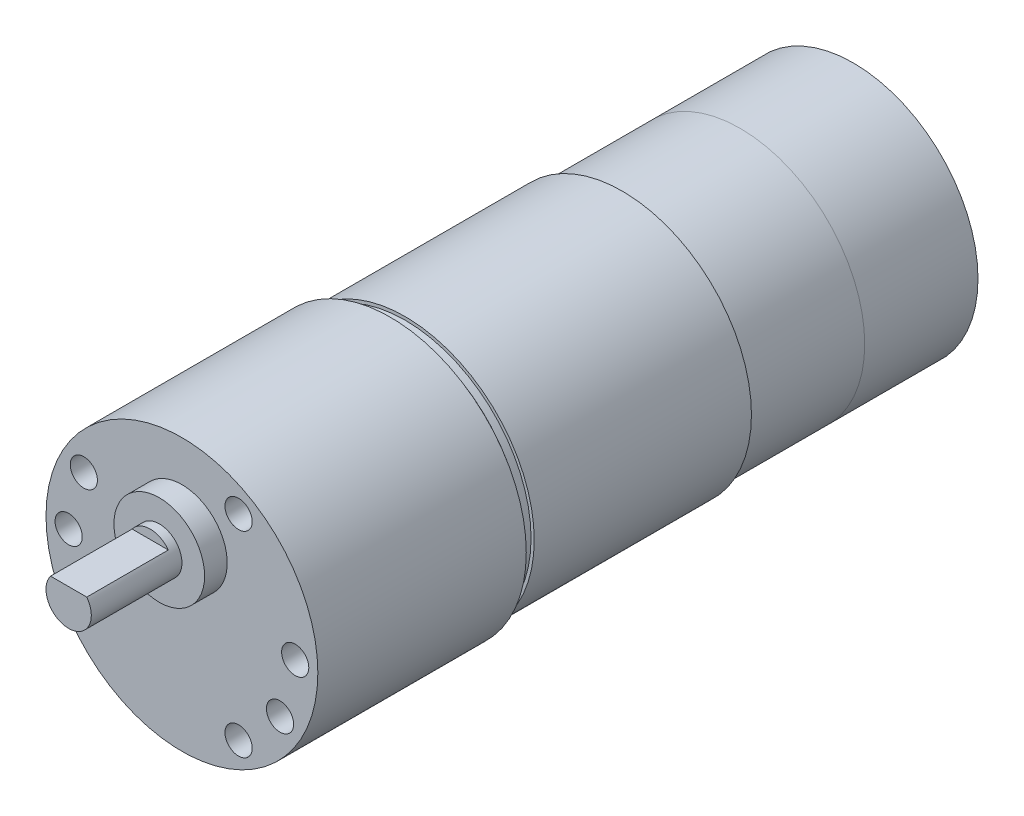
ISO-10303-21;
HEADER;
FILE_DESCRIPTION(('STEP AP214'),'2;1');
FILE_NAME('part.step','',(''),(''),'','','');
FILE_SCHEMA(('AUTOMOTIVE_DESIGN { 1 0 10303 214 1 1 1 1 }'));
ENDSEC;
DATA;
#1=APPLICATION_CONTEXT('core data for automotive mechanical design processes');
#2=APPLICATION_PROTOCOL_DEFINITION('international standard','automotive_design',2000,#1);
#3=PRODUCT_CONTEXT('',#1,'mechanical');
#4=PRODUCT('Part','Part','',(#3));
#5=PRODUCT_RELATED_PRODUCT_CATEGORY('part','',(#4));
#6=PRODUCT_DEFINITION_FORMATION('','',#4);
#7=PRODUCT_DEFINITION_CONTEXT('part definition',#1,'design');
#8=PRODUCT_DEFINITION('design','',#6,#7);
#9=PRODUCT_DEFINITION_SHAPE('','',#8);
#10=(LENGTH_UNIT() NAMED_UNIT(*) SI_UNIT(.MILLI.,.METRE.));
#11=(NAMED_UNIT(*) PLANE_ANGLE_UNIT() SI_UNIT($,.RADIAN.));
#12=(NAMED_UNIT(*) SI_UNIT($,.STERADIAN.) SOLID_ANGLE_UNIT());
#13=UNCERTAINTY_MEASURE_WITH_UNIT(LENGTH_MEASURE(1.E-05),#10,'distance_accuracy_value','');
#14=(GEOMETRIC_REPRESENTATION_CONTEXT(3) GLOBAL_UNCERTAINTY_ASSIGNED_CONTEXT((#13)) GLOBAL_UNIT_ASSIGNED_CONTEXT((#10,
#11,#12)) REPRESENTATION_CONTEXT('',''));
#15=CARTESIAN_POINT('',(0.,0.,0.));
#16=DIRECTION('',(0.,0.,1.));
#17=DIRECTION('',(1.,0.,0.));
#18=AXIS2_PLACEMENT_3D('',#15,#16,#17);
#19=CARTESIAN_POINT('',(0.,0.,-74.1));
#20=DIRECTION('',(0.,0.,1.));
#21=DIRECTION('',(1.,0.,0.));
#22=AXIS2_PLACEMENT_3D('',#19,#20,#21);
#23=CYLINDRICAL_SURFACE('',#22,13.75);
#24=CARTESIAN_POINT('',(0.,0.,-74.1));
#25=DIRECTION('',(0.,0.,-1.));
#26=DIRECTION('',(-1.,0.,0.));
#27=AXIS2_PLACEMENT_3D('',#24,#25,#26);
#28=CIRCLE('',#27,13.75);
#29=CARTESIAN_POINT('',(-13.75,0.,-74.1));
#30=VERTEX_POINT('',#29);
#31=EDGE_CURVE('E11',#30,#30,#28,.T.);
#32=ORIENTED_EDGE('',*,*,#31,.F.);
#33=EDGE_LOOP('',(#32));
#34=FACE_BOUND('',#33,.T.);
#35=CARTESIAN_POINT('',(0.,0.,-61.6));
#36=DIRECTION('',(0.,0.,-1.));
#37=DIRECTION('',(-1.,0.,0.));
#38=AXIS2_PLACEMENT_3D('',#35,#36,#37);
#39=CIRCLE('',#38,13.75);
#40=CARTESIAN_POINT('',(-13.75,0.,-61.6));
#41=VERTEX_POINT('',#40);
#42=EDGE_CURVE('E47',#41,#41,#39,.T.);
#43=ORIENTED_EDGE('',*,*,#42,.T.);
#44=EDGE_LOOP('',(#43));
#45=FACE_BOUND('',#44,.T.);
#46=ADVANCED_FACE('F44',(#34,#45),#23,.T.);
#47=CARTESIAN_POINT('',(0.,0.,-74.1));
#48=DIRECTION('',(0.,0.,-1.));
#49=DIRECTION('',(-1.,0.,0.));
#50=AXIS2_PLACEMENT_3D('',#47,#48,#49);
#51=PLANE('',#50);
#52=ORIENTED_EDGE('',*,*,#31,.T.);
#53=EDGE_LOOP('',(#52));
#54=FACE_BOUND('',#53,.T.);
#55=ADVANCED_FACE('F59',(#54),#51,.T.);
#56=CARTESIAN_POINT('',(0.,0.,-61.6));
#57=DIRECTION('',(0.,0.,-1.));
#58=DIRECTION('',(-1.,0.,0.));
#59=AXIS2_PLACEMENT_3D('',#56,#57,#58);
#60=PLANE('',#59);
#61=ORIENTED_EDGE('',*,*,#42,.F.);
#62=EDGE_LOOP('',(#61));
#63=FACE_BOUND('',#62,.T.);
#64=ADVANCED_FACE('F57',(#63),#60,.F.);
#65=CLOSED_SHELL('',(#46,#55,#64));
#66=MANIFOLD_SOLID_BREP('B2',#65);
#67=CARTESIAN_POINT('',(0.,5.5,2.5));
#68=DIRECTION('',(0.,0.,1.));
#69=DIRECTION('',(1.,0.,0.));
#70=AXIS2_PLACEMENT_3D('',#67,#68,#69);
#71=PLANE('',#70);
#72=CARTESIAN_POINT('',(0.,5.5,2.5));
#73=DIRECTION('',(0.,0.,1.));
#74=DIRECTION('',(1.,0.,0.));
#75=AXIS2_PLACEMENT_3D('',#72,#73,#74);
#76=CIRCLE('',#75,5.);
#77=CARTESIAN_POINT('',(5.,5.5,2.5));
#78=VERTEX_POINT('',#77);
#79=EDGE_CURVE('E137',#78,#78,#76,.T.);
#80=ORIENTED_EDGE('',*,*,#79,.T.);
#81=EDGE_LOOP('',(#80));
#82=FACE_BOUND('',#81,.T.);
#83=CARTESIAN_POINT('',(0.,5.5,2.5));
#84=DIRECTION('',(0.,0.,1.));
#85=DIRECTION('',(1.,0.,0.));
#86=AXIS2_PLACEMENT_3D('',#83,#84,#85);
#87=CIRCLE('',#86,2.5);
#88=CARTESIAN_POINT('',(2.5,5.5,2.5));
#89=VERTEX_POINT('',#88);
#90=EDGE_CURVE('E138',#89,#89,#87,.T.);
#91=ORIENTED_EDGE('',*,*,#90,.F.);
#92=EDGE_LOOP('',(#91));
#93=FACE_BOUND('',#92,.T.);
#94=ADVANCED_FACE('F99',(#82,#93),#71,.T.);
#95=CARTESIAN_POINT('',(0.,0.,0.));
#96=DIRECTION('',(0.,0.,-1.));
#97=DIRECTION('',(-1.,0.,0.));
#98=AXIS2_PLACEMENT_3D('',#95,#96,#97);
#99=PLANE('',#98);
#100=CARTESIAN_POINT('',(0.,0.,0.));
#101=DIRECTION('',(0.,0.,1.));
#102=DIRECTION('',(1.,0.,0.));
#103=AXIS2_PLACEMENT_3D('',#100,#101,#102);
#104=CIRCLE('',#103,15.);
#105=CARTESIAN_POINT('',(15.,0.,0.));
#106=VERTEX_POINT('',#105);
#107=EDGE_CURVE('E209',#106,#106,#104,.T.);
#108=ORIENTED_EDGE('',*,*,#107,.T.);
#109=EDGE_LOOP('',(#108));
#110=FACE_BOUND('',#109,.T.);
#111=CARTESIAN_POINT('',(-12.5,0.,0.));
#112=DIRECTION('',(0.,0.,1.));
#113=DIRECTION('',(1.,0.,0.));
#114=AXIS2_PLACEMENT_3D('',#111,#112,#113);
#115=CIRCLE('',#114,1.5);
#116=CARTESIAN_POINT('',(-11.,0.,0.));
#117=VERTEX_POINT('',#116);
#118=EDGE_CURVE('E174',#117,#117,#115,.T.);
#119=ORIENTED_EDGE('',*,*,#118,.F.);
#120=EDGE_LOOP('',(#119));
#121=FACE_BOUND('',#120,.T.);
#122=CARTESIAN_POINT('',(-10.8253175473055,6.24999999999993,0.));
#123=DIRECTION('',(0.,0.,1.));
#124=DIRECTION('',(1.,0.,0.));
#125=AXIS2_PLACEMENT_3D('',#122,#123,#124);
#126=CIRCLE('',#125,1.5);
#127=CARTESIAN_POINT('',(-9.32531754730552,6.24999999999993,0.));
#128=VERTEX_POINT('',#127);
#129=EDGE_CURVE('E168',#128,#128,#126,.T.);
#130=ORIENTED_EDGE('',*,*,#129,.F.);
#131=EDGE_LOOP('',(#130));
#132=FACE_BOUND('',#131,.T.);
#133=CARTESIAN_POINT('',(6.24999999999997,10.8253175473055,0.));
#134=DIRECTION('',(0.,0.,1.));
#135=DIRECTION('',(1.,0.,0.));
#136=AXIS2_PLACEMENT_3D('',#133,#134,#135);
#137=CIRCLE('',#136,1.5);
#138=CARTESIAN_POINT('',(7.74999999999997,10.8253175473055,0.));
#139=VERTEX_POINT('',#138);
#140=EDGE_CURVE('E162',#139,#139,#137,.T.);
#141=ORIENTED_EDGE('',*,*,#140,.F.);
#142=EDGE_LOOP('',(#141));
#143=FACE_BOUND('',#142,.T.);
#144=CARTESIAN_POINT('',(12.5,0.,0.));
#145=DIRECTION('',(0.,0.,1.));
#146=DIRECTION('',(1.,0.,0.));
#147=AXIS2_PLACEMENT_3D('',#144,#145,#146);
#148=CIRCLE('',#147,1.5);
#149=CARTESIAN_POINT('',(14.,0.,0.));
#150=VERTEX_POINT('',#149);
#151=EDGE_CURVE('E156',#150,#150,#148,.T.);
#152=ORIENTED_EDGE('',*,*,#151,.F.);
#153=EDGE_LOOP('',(#152));
#154=FACE_BOUND('',#153,.T.);
#155=CARTESIAN_POINT('',(10.8253175473055,-6.25000000000001,0.));
#156=DIRECTION('',(0.,0.,1.));
#157=DIRECTION('',(1.,0.,0.));
#158=AXIS2_PLACEMENT_3D('',#155,#156,#157);
#159=CIRCLE('',#158,1.5);
#160=CARTESIAN_POINT('',(12.3253175473055,-6.25000000000001,0.));
#161=VERTEX_POINT('',#160);
#162=EDGE_CURVE('E150',#161,#161,#159,.T.);
#163=ORIENTED_EDGE('',*,*,#162,.F.);
#164=EDGE_LOOP('',(#163));
#165=FACE_BOUND('',#164,.T.);
#166=CARTESIAN_POINT('',(6.24999999999998,-10.8253175473055,0.));
#167=DIRECTION('',(0.,0.,1.));
#168=DIRECTION('',(1.,0.,0.));
#169=AXIS2_PLACEMENT_3D('',#166,#167,#168);
#170=CIRCLE('',#169,1.5);
#171=CARTESIAN_POINT('',(7.74999999999998,-10.8253175473055,0.));
#172=VERTEX_POINT('',#171);
#173=EDGE_CURVE('E141',#172,#172,#170,.T.);
#174=ORIENTED_EDGE('',*,*,#173,.F.);
#175=EDGE_LOOP('',(#174));
#176=FACE_BOUND('',#175,.T.);
#177=CARTESIAN_POINT('',(0.,5.5,0.));
#178=DIRECTION('',(0.,0.,-1.));
#179=DIRECTION('',(-1.,0.,0.));
#180=AXIS2_PLACEMENT_3D('',#177,#178,#179);
#181=CIRCLE('',#180,5.);
#182=CARTESIAN_POINT('',(-5.,5.5,0.));
#183=VERTEX_POINT('',#182);
#184=EDGE_CURVE('E128',#183,#183,#181,.F.);
#185=ORIENTED_EDGE('',*,*,#184,.F.);
#186=EDGE_LOOP('',(#185));
#187=FACE_BOUND('',#186,.T.);
#188=ADVANCED_FACE('F101',(#110,#121,#132,#143,#154,#165,#176,#187),#99,.F.);
#189=CARTESIAN_POINT('',(0.,0.,0.));
#190=DIRECTION('',(0.,0.,1.));
#191=DIRECTION('',(1.,0.,0.));
#192=AXIS2_PLACEMENT_3D('',#189,#190,#191);
#193=CYLINDRICAL_SURFACE('',#192,15.);
#194=ORIENTED_EDGE('',*,*,#107,.F.);
#195=EDGE_LOOP('',(#194));
#196=FACE_BOUND('',#195,.T.);
#197=CARTESIAN_POINT('',(0.,0.,-23.));
#198=DIRECTION('',(0.,0.,1.));
#199=DIRECTION('',(1.,0.,0.));
#200=AXIS2_PLACEMENT_3D('',#197,#198,#199);
#201=CIRCLE('',#200,15.);
#202=CARTESIAN_POINT('',(15.,0.,-23.));
#203=VERTEX_POINT('',#202);
#204=EDGE_CURVE('E206',#203,#203,#201,.T.);
#205=ORIENTED_EDGE('',*,*,#204,.T.);
#206=EDGE_LOOP('',(#205));
#207=FACE_BOUND('',#206,.T.);
#208=ADVANCED_FACE('F218',(#196,#207),#193,.T.);
#209=CARTESIAN_POINT('',(0.,15.,-23.));
#210=DIRECTION('',(0.,0.,1.));
#211=DIRECTION('',(1.,0.,0.));
#212=AXIS2_PLACEMENT_3D('',#209,#210,#211);
#213=PLANE('',#212);
#214=ORIENTED_EDGE('',*,*,#204,.F.);
#215=EDGE_LOOP('',(#214));
#216=FACE_BOUND('',#215,.T.);
#217=CARTESIAN_POINT('',(0.,0.,-23.));
#218=DIRECTION('',(0.,0.,1.));
#219=DIRECTION('',(1.,0.,0.));
#220=AXIS2_PLACEMENT_3D('',#217,#218,#219);
#221=CIRCLE('',#220,13.1608692238094);
#222=CARTESIAN_POINT('',(13.1608692238094,0.,-23.));
#223=VERTEX_POINT('',#222);
#224=EDGE_CURVE('E203',#223,#223,#221,.T.);
#225=ORIENTED_EDGE('',*,*,#224,.T.);
#226=EDGE_LOOP('',(#225));
#227=FACE_BOUND('',#226,.T.);
#228=ADVANCED_FACE('F224',(#216,#227),#213,.F.);
#229=CARTESIAN_POINT('',(0.,0.,0.));
#230=DIRECTION('',(0.,0.,1.));
#231=DIRECTION('',(1.,0.,0.));
#232=AXIS2_PLACEMENT_3D('',#229,#230,#231);
#233=CYLINDRICAL_SURFACE('',#232,13.1608692238094);
#234=ORIENTED_EDGE('',*,*,#224,.F.);
#235=EDGE_LOOP('',(#234));
#236=FACE_BOUND('',#235,.T.);
#237=CARTESIAN_POINT('',(0.,0.,-23.8));
#238=DIRECTION('',(0.,0.,1.));
#239=DIRECTION('',(1.,0.,0.));
#240=AXIS2_PLACEMENT_3D('',#237,#238,#239);
#241=CIRCLE('',#240,13.1608692238094);
#242=CARTESIAN_POINT('',(13.1608692238094,0.,-23.8));
#243=VERTEX_POINT('',#242);
#244=EDGE_CURVE('E200',#243,#243,#241,.T.);
#245=ORIENTED_EDGE('',*,*,#244,.T.);
#246=EDGE_LOOP('',(#245));
#247=FACE_BOUND('',#246,.T.);
#248=ADVANCED_FACE('F322',(#236,#247),#233,.T.);
#249=CARTESIAN_POINT('',(0.,13.1608692238094,-23.8));
#250=DIRECTION('',(0.,0.,-1.));
#251=DIRECTION('',(-1.,0.,0.));
#252=AXIS2_PLACEMENT_3D('',#249,#250,#251);
#253=PLANE('',#252);
#254=ORIENTED_EDGE('',*,*,#244,.F.);
#255=EDGE_LOOP('',(#254));
#256=FACE_BOUND('',#255,.T.);
#257=CARTESIAN_POINT('',(0.,0.,-23.8));
#258=DIRECTION('',(0.,0.,1.));
#259=DIRECTION('',(1.,0.,0.));
#260=AXIS2_PLACEMENT_3D('',#257,#258,#259);
#261=CIRCLE('',#260,13.9001885477519);
#262=CARTESIAN_POINT('',(13.9001885477519,0.,-23.8));
#263=VERTEX_POINT('',#262);
#264=EDGE_CURVE('E197',#263,#263,#261,.T.);
#265=ORIENTED_EDGE('',*,*,#264,.T.);
#266=EDGE_LOOP('',(#265));
#267=FACE_BOUND('',#266,.T.);
#268=ADVANCED_FACE('F318',(#256,#267),#253,.F.);
#269=CARTESIAN_POINT('',(0.,0.,0.));
#270=DIRECTION('',(0.,0.,1.));
#271=DIRECTION('',(1.,0.,0.));
#272=AXIS2_PLACEMENT_3D('',#269,#270,#271);
#273=CYLINDRICAL_SURFACE('',#272,13.9001885477519);
#274=ORIENTED_EDGE('',*,*,#264,.F.);
#275=EDGE_LOOP('',(#274));
#276=FACE_BOUND('',#275,.T.);
#277=CARTESIAN_POINT('',(0.,0.,-24.6291574327881));
#278=DIRECTION('',(0.,0.,1.));
#279=DIRECTION('',(1.,0.,0.));
#280=AXIS2_PLACEMENT_3D('',#277,#278,#279);
#281=CIRCLE('',#280,13.9001885477519);
#282=CARTESIAN_POINT('',(13.9001885477519,0.,-24.6291574327881));
#283=VERTEX_POINT('',#282);
#284=EDGE_CURVE('E194',#283,#283,#281,.T.);
#285=ORIENTED_EDGE('',*,*,#284,.T.);
#286=EDGE_LOOP('',(#285));
#287=FACE_BOUND('',#286,.T.);
#288=ADVANCED_FACE('F314',(#276,#287),#273,.T.);
#289=CARTESIAN_POINT('',(0.,13.9001885477519,-24.6291574327881));
#290=DIRECTION('',(0.,0.,-1.));
#291=DIRECTION('',(-1.,0.,0.));
#292=AXIS2_PLACEMENT_3D('',#289,#290,#291);
#293=PLANE('',#292);
#294=ORIENTED_EDGE('',*,*,#284,.F.);
#295=EDGE_LOOP('',(#294));
#296=FACE_BOUND('',#295,.T.);
#297=CARTESIAN_POINT('',(0.,0.,-24.6291574327881));
#298=DIRECTION('',(0.,0.,1.));
#299=DIRECTION('',(1.,0.,0.));
#300=AXIS2_PLACEMENT_3D('',#297,#298,#299);
#301=CIRCLE('',#300,14.25);
#302=CARTESIAN_POINT('',(14.25,0.,-24.6291574327881));
#303=VERTEX_POINT('',#302);
#304=EDGE_CURVE('E191',#303,#303,#301,.T.);
#305=ORIENTED_EDGE('',*,*,#304,.T.);
#306=EDGE_LOOP('',(#305));
#307=FACE_BOUND('',#306,.T.);
#308=ADVANCED_FACE('F310',(#296,#307),#293,.F.);
#309=CARTESIAN_POINT('',(0.,0.,0.));
#310=DIRECTION('',(0.,0.,1.));
#311=DIRECTION('',(1.,0.,0.));
#312=AXIS2_PLACEMENT_3D('',#309,#310,#311);
#313=CYLINDRICAL_SURFACE('',#312,14.25);
#314=ORIENTED_EDGE('',*,*,#304,.F.);
#315=EDGE_LOOP('',(#314));
#316=FACE_BOUND('',#315,.T.);
#317=CARTESIAN_POINT('',(0.,0.,-48.6));
#318=DIRECTION('',(0.,0.,1.));
#319=DIRECTION('',(1.,0.,0.));
#320=AXIS2_PLACEMENT_3D('',#317,#318,#319);
#321=CIRCLE('',#320,14.25);
#322=CARTESIAN_POINT('',(14.25,0.,-48.6));
#323=VERTEX_POINT('',#322);
#324=EDGE_CURVE('E188',#323,#323,#321,.T.);
#325=ORIENTED_EDGE('',*,*,#324,.T.);
#326=EDGE_LOOP('',(#325));
#327=FACE_BOUND('',#326,.T.);
#328=ADVANCED_FACE('F306',(#316,#327),#313,.T.);
#329=CARTESIAN_POINT('',(0.,14.25,-48.6));
#330=DIRECTION('',(0.,0.,1.));
#331=DIRECTION('',(1.,0.,0.));
#332=AXIS2_PLACEMENT_3D('',#329,#330,#331);
#333=PLANE('',#332);
#334=ORIENTED_EDGE('',*,*,#324,.F.);
#335=EDGE_LOOP('',(#334));
#336=FACE_BOUND('',#335,.T.);
#337=CARTESIAN_POINT('',(0.,0.,-48.6));
#338=DIRECTION('',(0.,0.,1.));
#339=DIRECTION('',(1.,0.,0.));
#340=AXIS2_PLACEMENT_3D('',#337,#338,#339);
#341=CIRCLE('',#340,13.75);
#342=CARTESIAN_POINT('',(13.75,0.,-48.6));
#343=VERTEX_POINT('',#342);
#344=EDGE_CURVE('E185',#343,#343,#341,.T.);
#345=ORIENTED_EDGE('',*,*,#344,.T.);
#346=EDGE_LOOP('',(#345));
#347=FACE_BOUND('',#346,.T.);
#348=ADVANCED_FACE('F302',(#336,#347),#333,.F.);
#349=CARTESIAN_POINT('',(0.,0.,0.));
#350=DIRECTION('',(0.,0.,1.));
#351=DIRECTION('',(1.,0.,0.));
#352=AXIS2_PLACEMENT_3D('',#349,#350,#351);
#353=CYLINDRICAL_SURFACE('',#352,13.75);
#354=ORIENTED_EDGE('',*,*,#344,.F.);
#355=EDGE_LOOP('',(#354));
#356=FACE_BOUND('',#355,.T.);
#357=CARTESIAN_POINT('',(0.,0.,-61.6));
#358=DIRECTION('',(0.,0.,1.));
#359=DIRECTION('',(1.,0.,0.));
#360=AXIS2_PLACEMENT_3D('',#357,#358,#359);
#361=CIRCLE('',#360,13.75);
#362=CARTESIAN_POINT('',(13.75,0.,-61.6));
#363=VERTEX_POINT('',#362);
#364=EDGE_CURVE('E180',#363,#363,#361,.T.);
#365=ORIENTED_EDGE('',*,*,#364,.T.);
#366=EDGE_LOOP('',(#365));
#367=FACE_BOUND('',#366,.T.);
#368=ADVANCED_FACE('F298',(#356,#367),#353,.T.);
#369=CARTESIAN_POINT('',(0.,13.75,-61.6));
#370=DIRECTION('',(0.,0.,1.));
#371=DIRECTION('',(1.,0.,0.));
#372=AXIS2_PLACEMENT_3D('',#369,#370,#371);
#373=PLANE('',#372);
#374=ORIENTED_EDGE('',*,*,#364,.F.);
#375=EDGE_LOOP('',(#374));
#376=FACE_BOUND('',#375,.T.);
#377=ADVANCED_FACE('F294',(#376),#373,.F.);
#378=CARTESIAN_POINT('',(-12.5,0.,-4.));
#379=DIRECTION('',(0.,0.,1.));
#380=DIRECTION('',(1.,0.,0.));
#381=AXIS2_PLACEMENT_3D('',#378,#379,#380);
#382=CYLINDRICAL_SURFACE('',#381,1.5);
#383=CARTESIAN_POINT('',(-12.5,0.,-4.));
#384=DIRECTION('',(0.,0.,1.));
#385=DIRECTION('',(1.,0.,0.));
#386=AXIS2_PLACEMENT_3D('',#383,#384,#385);
#387=CIRCLE('',#386,1.5);
#388=CARTESIAN_POINT('',(-11.,0.,-4.));
#389=VERTEX_POINT('',#388);
#390=EDGE_CURVE('E177',#389,#389,#387,.T.);
#391=ORIENTED_EDGE('',*,*,#390,.F.);
#392=EDGE_LOOP('',(#391));
#393=FACE_BOUND('',#392,.T.);
#394=ORIENTED_EDGE('',*,*,#118,.T.);
#395=EDGE_LOOP('',(#394));
#396=FACE_BOUND('',#395,.T.);
#397=ADVANCED_FACE('F290',(#393,#396),#382,.F.);
#398=CARTESIAN_POINT('',(-12.5,0.,-4.));
#399=DIRECTION('',(0.,0.,1.));
#400=DIRECTION('',(1.,0.,0.));
#401=AXIS2_PLACEMENT_3D('',#398,#399,#400);
#402=PLANE('',#401);
#403=ORIENTED_EDGE('',*,*,#390,.T.);
#404=EDGE_LOOP('',(#403));
#405=FACE_BOUND('',#404,.T.);
#406=ADVANCED_FACE('F286',(#405),#402,.T.);
#407=CARTESIAN_POINT('',(-10.8253175473055,6.24999999999993,-4.));
#408=DIRECTION('',(0.,0.,1.));
#409=DIRECTION('',(1.,0.,0.));
#410=AXIS2_PLACEMENT_3D('',#407,#408,#409);
#411=CYLINDRICAL_SURFACE('',#410,1.5);
#412=CARTESIAN_POINT('',(-10.8253175473055,6.24999999999993,-4.));
#413=DIRECTION('',(0.,0.,1.));
#414=DIRECTION('',(1.,0.,0.));
#415=AXIS2_PLACEMENT_3D('',#412,#413,#414);
#416=CIRCLE('',#415,1.5);
#417=CARTESIAN_POINT('',(-9.32531754730552,6.24999999999993,-4.));
#418=VERTEX_POINT('',#417);
#419=EDGE_CURVE('E171',#418,#418,#416,.T.);
#420=ORIENTED_EDGE('',*,*,#419,.F.);
#421=EDGE_LOOP('',(#420));
#422=FACE_BOUND('',#421,.T.);
#423=ORIENTED_EDGE('',*,*,#129,.T.);
#424=EDGE_LOOP('',(#423));
#425=FACE_BOUND('',#424,.T.);
#426=ADVANCED_FACE('F282',(#422,#425),#411,.F.);
#427=CARTESIAN_POINT('',(-10.8253175473055,6.24999999999993,-4.));
#428=DIRECTION('',(0.,0.,1.));
#429=DIRECTION('',(1.,0.,0.));
#430=AXIS2_PLACEMENT_3D('',#427,#428,#429);
#431=PLANE('',#430);
#432=ORIENTED_EDGE('',*,*,#419,.T.);
#433=EDGE_LOOP('',(#432));
#434=FACE_BOUND('',#433,.T.);
#435=ADVANCED_FACE('F278',(#434),#431,.T.);
#436=CARTESIAN_POINT('',(6.24999999999997,10.8253175473055,-4.));
#437=DIRECTION('',(0.,0.,1.));
#438=DIRECTION('',(1.,0.,0.));
#439=AXIS2_PLACEMENT_3D('',#436,#437,#438);
#440=CYLINDRICAL_SURFACE('',#439,1.5);
#441=CARTESIAN_POINT('',(6.24999999999997,10.8253175473055,-4.));
#442=DIRECTION('',(0.,0.,1.));
#443=DIRECTION('',(1.,0.,0.));
#444=AXIS2_PLACEMENT_3D('',#441,#442,#443);
#445=CIRCLE('',#444,1.5);
#446=CARTESIAN_POINT('',(7.74999999999997,10.8253175473055,-4.));
#447=VERTEX_POINT('',#446);
#448=EDGE_CURVE('E165',#447,#447,#445,.T.);
#449=ORIENTED_EDGE('',*,*,#448,.F.);
#450=EDGE_LOOP('',(#449));
#451=FACE_BOUND('',#450,.T.);
#452=ORIENTED_EDGE('',*,*,#140,.T.);
#453=EDGE_LOOP('',(#452));
#454=FACE_BOUND('',#453,.T.);
#455=ADVANCED_FACE('F274',(#451,#454),#440,.F.);
#456=CARTESIAN_POINT('',(6.24999999999997,10.8253175473055,-4.));
#457=DIRECTION('',(0.,0.,1.));
#458=DIRECTION('',(1.,0.,0.));
#459=AXIS2_PLACEMENT_3D('',#456,#457,#458);
#460=PLANE('',#459);
#461=ORIENTED_EDGE('',*,*,#448,.T.);
#462=EDGE_LOOP('',(#461));
#463=FACE_BOUND('',#462,.T.);
#464=ADVANCED_FACE('F270',(#463),#460,.T.);
#465=CARTESIAN_POINT('',(12.5,0.,-4.));
#466=DIRECTION('',(0.,0.,1.));
#467=DIRECTION('',(1.,0.,0.));
#468=AXIS2_PLACEMENT_3D('',#465,#466,#467);
#469=CYLINDRICAL_SURFACE('',#468,1.5);
#470=CARTESIAN_POINT('',(12.5,0.,-4.));
#471=DIRECTION('',(0.,0.,1.));
#472=DIRECTION('',(1.,0.,0.));
#473=AXIS2_PLACEMENT_3D('',#470,#471,#472);
#474=CIRCLE('',#473,1.5);
#475=CARTESIAN_POINT('',(14.,0.,-4.));
#476=VERTEX_POINT('',#475);
#477=EDGE_CURVE('E159',#476,#476,#474,.T.);
#478=ORIENTED_EDGE('',*,*,#477,.F.);
#479=EDGE_LOOP('',(#478));
#480=FACE_BOUND('',#479,.T.);
#481=ORIENTED_EDGE('',*,*,#151,.T.);
#482=EDGE_LOOP('',(#481));
#483=FACE_BOUND('',#482,.T.);
#484=ADVANCED_FACE('F266',(#480,#483),#469,.F.);
#485=CARTESIAN_POINT('',(12.5,0.,-4.));
#486=DIRECTION('',(0.,0.,1.));
#487=DIRECTION('',(1.,0.,0.));
#488=AXIS2_PLACEMENT_3D('',#485,#486,#487);
#489=PLANE('',#488);
#490=ORIENTED_EDGE('',*,*,#477,.T.);
#491=EDGE_LOOP('',(#490));
#492=FACE_BOUND('',#491,.T.);
#493=ADVANCED_FACE('F262',(#492),#489,.T.);
#494=CARTESIAN_POINT('',(10.8253175473055,-6.25000000000001,-4.));
#495=DIRECTION('',(0.,0.,1.));
#496=DIRECTION('',(1.,0.,0.));
#497=AXIS2_PLACEMENT_3D('',#494,#495,#496);
#498=CYLINDRICAL_SURFACE('',#497,1.5);
#499=CARTESIAN_POINT('',(10.8253175473055,-6.25000000000001,-4.));
#500=DIRECTION('',(0.,0.,1.));
#501=DIRECTION('',(1.,0.,0.));
#502=AXIS2_PLACEMENT_3D('',#499,#500,#501);
#503=CIRCLE('',#502,1.5);
#504=CARTESIAN_POINT('',(12.3253175473055,-6.25000000000001,-4.));
#505=VERTEX_POINT('',#504);
#506=EDGE_CURVE('E153',#505,#505,#503,.T.);
#507=ORIENTED_EDGE('',*,*,#506,.F.);
#508=EDGE_LOOP('',(#507));
#509=FACE_BOUND('',#508,.T.);
#510=ORIENTED_EDGE('',*,*,#162,.T.);
#511=EDGE_LOOP('',(#510));
#512=FACE_BOUND('',#511,.T.);
#513=ADVANCED_FACE('F254',(#509,#512),#498,.F.);
#514=CARTESIAN_POINT('',(10.8253175473055,-6.25000000000001,-4.));
#515=DIRECTION('',(0.,0.,1.));
#516=DIRECTION('',(1.,0.,0.));
#517=AXIS2_PLACEMENT_3D('',#514,#515,#516);
#518=PLANE('',#517);
#519=ORIENTED_EDGE('',*,*,#506,.T.);
#520=EDGE_LOOP('',(#519));
#521=FACE_BOUND('',#520,.T.);
#522=ADVANCED_FACE('F245',(#521),#518,.T.);
#523=CARTESIAN_POINT('',(6.24999999999998,-10.8253175473055,-4.));
#524=DIRECTION('',(0.,0.,1.));
#525=DIRECTION('',(1.,0.,0.));
#526=AXIS2_PLACEMENT_3D('',#523,#524,#525);
#527=CYLINDRICAL_SURFACE('',#526,1.5);
#528=CARTESIAN_POINT('',(6.24999999999998,-10.8253175473055,-4.));
#529=DIRECTION('',(0.,0.,1.));
#530=DIRECTION('',(1.,0.,0.));
#531=AXIS2_PLACEMENT_3D('',#528,#529,#530);
#532=CIRCLE('',#531,1.5);
#533=CARTESIAN_POINT('',(7.74999999999998,-10.8253175473055,-4.));
#534=VERTEX_POINT('',#533);
#535=EDGE_CURVE('E147',#534,#534,#532,.T.);
#536=ORIENTED_EDGE('',*,*,#535,.F.);
#537=EDGE_LOOP('',(#536));
#538=FACE_BOUND('',#537,.T.);
#539=ORIENTED_EDGE('',*,*,#173,.T.);
#540=EDGE_LOOP('',(#539));
#541=FACE_BOUND('',#540,.T.);
#542=ADVANCED_FACE('F242',(#538,#541),#527,.F.);
#543=CARTESIAN_POINT('',(6.24999999999998,-10.8253175473055,-4.));
#544=DIRECTION('',(0.,0.,1.));
#545=DIRECTION('',(1.,0.,0.));
#546=AXIS2_PLACEMENT_3D('',#543,#544,#545);
#547=PLANE('',#546);
#548=ORIENTED_EDGE('',*,*,#535,.T.);
#549=EDGE_LOOP('',(#548));
#550=FACE_BOUND('',#549,.T.);
#551=ADVANCED_FACE('F244',(#550),#547,.T.);
#552=CARTESIAN_POINT('',(0.,5.5,2.5));
#553=DIRECTION('',(0.,0.,-1.));
#554=DIRECTION('',(-1.,0.,0.));
#555=AXIS2_PLACEMENT_3D('',#552,#553,#554);
#556=CYLINDRICAL_SURFACE('',#555,5.);
#557=ORIENTED_EDGE('',*,*,#79,.F.);
#558=EDGE_LOOP('',(#557));
#559=FACE_BOUND('',#558,.T.);
#560=ORIENTED_EDGE('',*,*,#184,.T.);
#561=EDGE_LOOP('',(#560));
#562=FACE_BOUND('',#561,.T.);
#563=ADVANCED_FACE('F215',(#559,#562),#556,.T.);
#564=CARTESIAN_POINT('',(0.,5.5,12.5));
#565=DIRECTION('',(0.,0.,-1.));
#566=DIRECTION('',(-1.,0.,0.));
#567=AXIS2_PLACEMENT_3D('',#564,#565,#566);
#568=CYLINDRICAL_SURFACE('',#567,2.5);
#569=CARTESIAN_POINT('',(0.,5.5,12.5));
#570=DIRECTION('',(0.,0.,1.));
#571=DIRECTION('',(1.,0.,0.));
#572=AXIS2_PLACEMENT_3D('',#569,#570,#571);
#573=CIRCLE('',#572,2.5);
#574=CARTESIAN_POINT('',(-2.,7.,12.5));
#575=VERTEX_POINT('',#574);
#576=CARTESIAN_POINT('',(2.,7.,12.5));
#577=VERTEX_POINT('',#576);
#578=EDGE_CURVE('E133',#575,#577,#573,.T.);
#579=ORIENTED_EDGE('',*,*,#578,.F.);
#580=DIRECTION('',(0.,0.,-1.));
#581=VECTOR('',#580,1.);
#582=CARTESIAN_POINT('',(-2.,7.,12.5));
#583=LINE('',#582,#581);
#584=CARTESIAN_POINT('',(-2.,7.,3.5));
#585=VERTEX_POINT('',#584);
#586=EDGE_CURVE('E114',#575,#585,#583,.T.);
#587=ORIENTED_EDGE('',*,*,#586,.T.);
#588=CARTESIAN_POINT('',(0.,5.5,3.5));
#589=DIRECTION('',(0.,0.,1.));
#590=DIRECTION('',(1.,0.,0.));
#591=AXIS2_PLACEMENT_3D('',#588,#589,#590);
#592=CIRCLE('',#591,2.5);
#593=CARTESIAN_POINT('',(2.,7.,3.5));
#594=VERTEX_POINT('',#593);
#595=EDGE_CURVE('E42',#594,#585,#592,.T.);
#596=ORIENTED_EDGE('',*,*,#595,.F.);
#597=DIRECTION('',(0.,0.,-1.));
#598=VECTOR('',#597,1.);
#599=CARTESIAN_POINT('',(2.,7.,12.5));
#600=LINE('',#599,#598);
#601=EDGE_CURVE('E119',#594,#577,#600,.F.);
#602=ORIENTED_EDGE('',*,*,#601,.T.);
#603=EDGE_LOOP('',(#579,#587,#596,#602));
#604=FACE_BOUND('',#603,.T.);
#605=ORIENTED_EDGE('',*,*,#90,.T.);
#606=EDGE_LOOP('',(#605));
#607=FACE_BOUND('',#606,.T.);
#608=ADVANCED_FACE('F131',(#604,#607),#568,.T.);
#609=CARTESIAN_POINT('',(0.,5.5,12.5));
#610=DIRECTION('',(0.,0.,1.));
#611=DIRECTION('',(1.,0.,0.));
#612=AXIS2_PLACEMENT_3D('',#609,#610,#611);
#613=PLANE('',#612);
#614=DIRECTION('',(1.,0.,0.));
#615=VECTOR('',#614,1.);
#616=CARTESIAN_POINT('',(0.,7.,12.5));
#617=LINE('',#616,#615);
#618=EDGE_CURVE('E107',#575,#577,#617,.T.);
#619=ORIENTED_EDGE('',*,*,#618,.F.);
#620=ORIENTED_EDGE('',*,*,#578,.T.);
#621=EDGE_LOOP('',(#619,#620));
#622=FACE_BOUND('',#621,.T.);
#623=ADVANCED_FACE('F136',(#622),#613,.T.);
#624=CARTESIAN_POINT('',(0.,0.,3.5));
#625=DIRECTION('',(0.,0.,1.));
#626=DIRECTION('',(1.,0.,0.));
#627=AXIS2_PLACEMENT_3D('',#624,#625,#626);
#628=PLANE('',#627);
#629=ORIENTED_EDGE('',*,*,#595,.T.);
#630=DIRECTION('',(1.,0.,0.));
#631=VECTOR('',#630,1.);
#632=CARTESIAN_POINT('',(-2.64046696846131,7.,3.5));
#633=LINE('',#632,#631);
#634=EDGE_CURVE('E134',#585,#594,#633,.T.);
#635=ORIENTED_EDGE('',*,*,#634,.T.);
#636=EDGE_LOOP('',(#629,#635));
#637=FACE_BOUND('',#636,.T.);
#638=ADVANCED_FACE('F468',(#637),#628,.T.);
#639=CARTESIAN_POINT('',(-2.64046696846131,7.,3.5));
#640=DIRECTION('',(0.,-1.,0.));
#641=DIRECTION('',(0.,0.,-1.));
#642=AXIS2_PLACEMENT_3D('',#639,#640,#641);
#643=PLANE('',#642);
#644=ORIENTED_EDGE('',*,*,#618,.T.);
#645=ORIENTED_EDGE('',*,*,#601,.F.);
#646=ORIENTED_EDGE('',*,*,#634,.F.);
#647=ORIENTED_EDGE('',*,*,#586,.F.);
#648=EDGE_LOOP('',(#644,#645,#646,#647));
#649=FACE_BOUND('',#648,.T.);
#650=ADVANCED_FACE('F124',(#649),#643,.F.);
#651=CLOSED_SHELL('',(#94,#188,#208,#228,#248,#268,#288,#308,#328,#348,#368,#377,#397,#406,#426,
#435,#455,#464,#484,#493,#513,#522,#542,#551,#563,#608,#623,#638,#650));
#652=MANIFOLD_SOLID_BREP('B6',#651);
#653=ADVANCED_BREP_SHAPE_REPRESENTATION('',(#18,#66,#652),#14);
#654=SHAPE_DEFINITION_REPRESENTATION(#9,#653);
ENDSEC;
END-ISO-10303-21;
